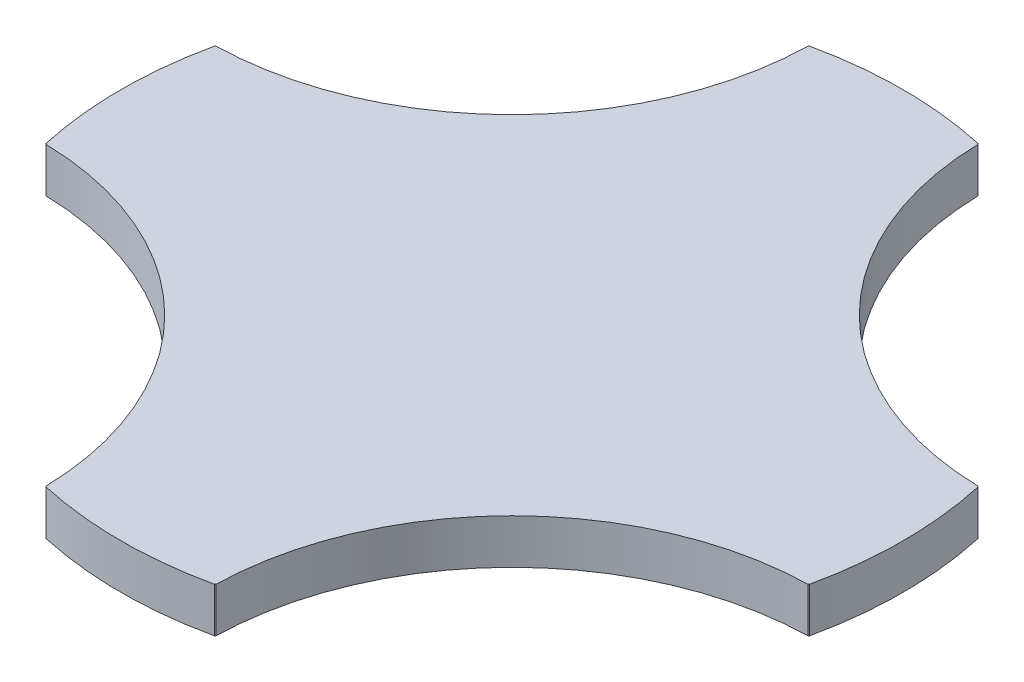
ISO-10303-21;
HEADER;
FILE_DESCRIPTION(('STEP AP214'),'2;1');
FILE_NAME('part.step','',(''),(''),'','','');
FILE_SCHEMA(('AUTOMOTIVE_DESIGN { 1 0 10303 214 1 1 1 1 }'));
ENDSEC;
DATA;
#1=APPLICATION_CONTEXT('core data for automotive mechanical design processes');
#2=APPLICATION_PROTOCOL_DEFINITION('international standard','automotive_design',2000,#1);
#3=PRODUCT_CONTEXT('',#1,'mechanical');
#4=PRODUCT('Part','Part','',(#3));
#5=PRODUCT_RELATED_PRODUCT_CATEGORY('part','',(#4));
#6=PRODUCT_DEFINITION_FORMATION('','',#4);
#7=PRODUCT_DEFINITION_CONTEXT('part definition',#1,'design');
#8=PRODUCT_DEFINITION('design','',#6,#7);
#9=PRODUCT_DEFINITION_SHAPE('','',#8);
#10=(LENGTH_UNIT() NAMED_UNIT(*) SI_UNIT(.MILLI.,.METRE.));
#11=(NAMED_UNIT(*) PLANE_ANGLE_UNIT() SI_UNIT($,.RADIAN.));
#12=(NAMED_UNIT(*) SI_UNIT($,.STERADIAN.) SOLID_ANGLE_UNIT());
#13=UNCERTAINTY_MEASURE_WITH_UNIT(LENGTH_MEASURE(1.E-05),#10,'distance_accuracy_value','');
#14=(GEOMETRIC_REPRESENTATION_CONTEXT(3) GLOBAL_UNCERTAINTY_ASSIGNED_CONTEXT((#13)) GLOBAL_UNIT_ASSIGNED_CONTEXT((#10,
#11,#12)) REPRESENTATION_CONTEXT('',''));
#15=CARTESIAN_POINT('',(0.,0.,0.));
#16=DIRECTION('',(0.,0.,1.));
#17=DIRECTION('',(1.,0.,0.));
#18=AXIS2_PLACEMENT_3D('',#15,#16,#17);
#19=CARTESIAN_POINT('',(3.12438789065523,0.359999999988175,-3.12438789064291));
#20=DIRECTION('',(0.,-1.00000000000002,0.));
#21=DIRECTION('',(0.,0.,-1.00000000000002));
#22=AXIS2_PLACEMENT_3D('',#19,#20,#21);
#23=CYLINDRICAL_SURFACE('',#22,2.44);
#24=CARTESIAN_POINT('',(3.12438789065044,-1.74860126378462E-12,-3.12438789064499));
#25=DIRECTION('',(0.,1.00000000000002,0.));
#26=DIRECTION('',(0.,0.,1.00000000000002));
#27=AXIS2_PLACEMENT_3D('',#24,#25,#26);
#28=CIRCLE('',#27,2.44);
#29=CARTESIAN_POINT('',(0.685000000012145,-2.75890421619351E-11,-3.06973700808647));
#30=VERTEX_POINT('',#29);
#31=CARTESIAN_POINT('',(3.06973700810711,-1.9595436384634E-11,-0.684999999991727));
#32=VERTEX_POINT('',#31);
#33=EDGE_CURVE('E176',#30,#32,#28,.T.);
#34=ORIENTED_EDGE('',*,*,#33,.F.);
#35=DIRECTION('',(0.,-1.00000000000002,0.));
#36=VECTOR('',#35,1.);
#37=CARTESIAN_POINT('',(0.685000000013772,0.359999999991645,-3.06973700808749));
#38=LINE('',#37,#36);
#39=CARTESIAN_POINT('',(0.685000000013772,0.359999999991645,-3.06973700808749));
#40=VERTEX_POINT('',#39);
#41=EDGE_CURVE('E11',#40,#30,#38,.T.);
#42=ORIENTED_EDGE('',*,*,#41,.F.);
#43=CARTESIAN_POINT('',(3.12438789065523,0.359999999988175,-3.12438789064291));
#44=DIRECTION('',(0.,1.00000000000002,0.));
#45=DIRECTION('',(0.,0.,1.00000000000002));
#46=AXIS2_PLACEMENT_3D('',#43,#44,#45);
#47=CIRCLE('',#46,2.44);
#48=CARTESIAN_POINT('',(3.06973700810863,0.359999999981861,-0.684999999990422));
#49=VERTEX_POINT('',#48);
#50=EDGE_CURVE('E217',#40,#49,#47,.T.);
#51=ORIENTED_EDGE('',*,*,#50,.T.);
#52=DIRECTION('',(0.,-1.00000000000002,0.));
#53=VECTOR('',#52,1.);
#54=CARTESIAN_POINT('',(3.06973700810863,0.359999999981861,-0.684999999990422));
#55=LINE('',#54,#53);
#56=EDGE_CURVE('E52',#49,#32,#55,.T.);
#57=ORIENTED_EDGE('',*,*,#56,.T.);
#58=EDGE_LOOP('',(#34,#42,#51,#57));
#59=FACE_BOUND('',#58,.T.);
#60=ADVANCED_FACE('F36',(#59),#23,.F.);
#61=CARTESIAN_POINT('',(1.87736850405985,0.359999999986343,-1.87736850403478));
#62=DIRECTION('',(0.7071067811868,0.,-0.707106781186299));
#63=DIRECTION('',(-0.707106781186278,0.,-0.707106781186803));
#64=AXIS2_PLACEMENT_3D('',#61,#62,#63);
#65=PLANE('',#64);
#66=DIRECTION('',(0.707106781186278,0.,0.707106781186803));
#67=VECTOR('',#66,1.);
#68=CARTESIAN_POINT('',(1.87736850405876,-1.41969769273942E-11,-1.87736850404097));
#69=LINE('',#68,#67);
#70=CARTESIAN_POINT('',(0.678728649891262,-2.13440376484186E-11,-3.07600835820996));
#71=VERTEX_POINT('',#70);
#72=EDGE_CURVE('E178',#71,#30,#69,.T.);
#73=ORIENTED_EDGE('',*,*,#72,.F.);
#74=DIRECTION('',(0.,-1.00000000000002,0.));
#75=VECTOR('',#74,1.);
#76=CARTESIAN_POINT('',(0.678728649882717,0.359999999985441,-3.07600835821438));
#77=LINE('',#76,#75);
#78=CARTESIAN_POINT('',(0.678728649882717,0.359999999985441,-3.07600835821438));
#79=VERTEX_POINT('',#78);
#80=EDGE_CURVE('E44',#79,#71,#77,.T.);
#81=ORIENTED_EDGE('',*,*,#80,.F.);
#82=DIRECTION('',(0.707106781186278,0.,0.707106781186803));
#83=VECTOR('',#82,1.);
#84=CARTESIAN_POINT('',(1.87736850405985,0.359999999986343,-1.87736850403478));
#85=LINE('',#84,#83);
#86=EDGE_CURVE('E257',#79,#40,#85,.T.);
#87=ORIENTED_EDGE('',*,*,#86,.T.);
#88=ORIENTED_EDGE('',*,*,#41,.T.);
#89=EDGE_LOOP('',(#73,#81,#87,#88));
#90=FACE_BOUND('',#89,.T.);
#91=ADVANCED_FACE('F256',(#90),#65,.T.);
#92=CARTESIAN_POINT('',(6.89379109353183E-12,0.35999999998812,4.48252546192407E-12));
#93=DIRECTION('',(0.,-1.00000000000002,0.));
#94=DIRECTION('',(0.,0.,-1.00000000000002));
#95=AXIS2_PLACEMENT_3D('',#92,#93,#94);
#96=CYLINDRICAL_SURFACE('',#95,3.15);
#97=CARTESIAN_POINT('',(0.,0.,0.));
#98=DIRECTION('',(0.,1.00000000000002,0.));
#99=DIRECTION('',(0.,0.,1.00000000000002));
#100=AXIS2_PLACEMENT_3D('',#97,#98,#99);
#101=CIRCLE('',#100,3.15);
#102=CARTESIAN_POINT('',(-0.678728649876436,-1.24622534514174E-11,-3.07600835820553));
#103=VERTEX_POINT('',#102);
#104=EDGE_CURVE('E181',#71,#103,#101,.T.);
#105=ORIENTED_EDGE('',*,*,#104,.T.);
#106=DIRECTION('',(0.,-1.00000000000002,0.));
#107=VECTOR('',#106,1.);
#108=CARTESIAN_POINT('',(-0.678728649874989,0.359999999979252,-3.07600835820862));
#109=LINE('',#108,#107);
#110=CARTESIAN_POINT('',(-0.678728649874989,0.359999999979252,-3.07600835820862));
#111=VERTEX_POINT('',#110);
#112=EDGE_CURVE('E242',#111,#103,#109,.T.);
#113=ORIENTED_EDGE('',*,*,#112,.F.);
#114=CARTESIAN_POINT('',(6.89379109353183E-12,0.35999999998812,4.48252546192407E-12));
#115=DIRECTION('',(0.,1.00000000000002,0.));
#116=DIRECTION('',(0.,0.,1.00000000000002));
#117=AXIS2_PLACEMENT_3D('',#114,#115,#116);
#118=CIRCLE('',#117,3.15);
#119=EDGE_CURVE('E248',#79,#111,#118,.T.);
#120=ORIENTED_EDGE('',*,*,#119,.F.);
#121=ORIENTED_EDGE('',*,*,#80,.T.);
#122=EDGE_LOOP('',(#105,#113,#120,#121));
#123=FACE_BOUND('',#122,.T.);
#124=ADVANCED_FACE('F246',(#123),#96,.T.);
#125=CARTESIAN_POINT('',(-1.8773685040446,0.359999999989952,-1.87736850404993));
#126=DIRECTION('',(-0.707106781186413,0.,-0.707106781186668));
#127=DIRECTION('',(-0.707106781186666,0.,0.707106781186433));
#128=AXIS2_PLACEMENT_3D('',#125,#126,#127);
#129=PLANE('',#128);
#130=DIRECTION('',(0.707106781186666,0.,-0.707106781186433));
#131=VECTOR('',#130,1.);
#132=CARTESIAN_POINT('',(-1.87736850404043,-2.04003480774873E-11,-1.87736850404054));
#133=LINE('',#132,#131);
#134=CARTESIAN_POINT('',(-0.684999999988349,-1.95260474455949E-11,-3.06973700809876));
#135=VERTEX_POINT('',#134);
#136=EDGE_CURVE('E184',#135,#103,#133,.T.);
#137=ORIENTED_EDGE('',*,*,#136,.F.);
#138=DIRECTION('',(0.,-1.00000000000002,0.));
#139=VECTOR('',#138,1.);
#140=CARTESIAN_POINT('',(-0.68499999998589,0.359999999980154,-3.06973700809741));
#141=LINE('',#140,#139);
#142=CARTESIAN_POINT('',(-0.68499999998589,0.359999999980154,-3.06973700809741));
#143=VERTEX_POINT('',#142);
#144=EDGE_CURVE('E240',#143,#135,#141,.T.);
#145=ORIENTED_EDGE('',*,*,#144,.F.);
#146=DIRECTION('',(0.707106781186666,0.,-0.707106781186433));
#147=VECTOR('',#146,1.);
#148=CARTESIAN_POINT('',(-1.8773685040446,0.359999999989952,-1.87736850404993));
#149=LINE('',#148,#147);
#150=EDGE_CURVE('E454',#143,#111,#149,.T.);
#151=ORIENTED_EDGE('',*,*,#150,.T.);
#152=ORIENTED_EDGE('',*,*,#112,.T.);
#153=EDGE_LOOP('',(#137,#145,#151,#152));
#154=FACE_BOUND('',#153,.T.);
#155=ADVANCED_FACE('F275',(#154),#129,.T.);
#156=CARTESIAN_POINT('',(-3.12438789063748,0.359999999989924,-3.12438789063895));
#157=DIRECTION('',(0.,-1.00000000000002,0.));
#158=DIRECTION('',(0.,0.,-1.00000000000002));
#159=AXIS2_PLACEMENT_3D('',#156,#157,#158);
#160=CYLINDRICAL_SURFACE('',#159,2.44);
#161=CARTESIAN_POINT('',(-3.1243878906377,-2.12885264971874E-11,-3.12438789063994));
#162=DIRECTION('',(0.,1.00000000000002,0.));
#163=DIRECTION('',(0.,0.,1.00000000000002));
#164=AXIS2_PLACEMENT_3D('',#161,#162,#163);
#165=CIRCLE('',#164,2.44);
#166=CARTESIAN_POINT('',(-3.06973700810717,-8.88178419700125E-13,-0.684999999998638));
#167=VERTEX_POINT('',#166);
#168=EDGE_CURVE('E187',#167,#135,#165,.T.);
#169=ORIENTED_EDGE('',*,*,#168,.F.);
#170=DIRECTION('',(0.,-1.00000000000002,0.));
#171=VECTOR('',#170,1.);
#172=CARTESIAN_POINT('',(-3.06973700809725,0.359999999981916,-0.684999999991491));
#173=LINE('',#172,#171);
#174=CARTESIAN_POINT('',(-3.06973700809725,0.359999999981916,-0.684999999991491));
#175=VERTEX_POINT('',#174);
#176=EDGE_CURVE('E238',#175,#167,#173,.T.);
#177=ORIENTED_EDGE('',*,*,#176,.F.);
#178=CARTESIAN_POINT('',(-3.12438789063748,0.359999999989924,-3.12438789063895));
#179=DIRECTION('',(0.,1.00000000000002,0.));
#180=DIRECTION('',(0.,0.,1.00000000000002));
#181=AXIS2_PLACEMENT_3D('',#178,#179,#180);
#182=CIRCLE('',#181,2.44);
#183=EDGE_CURVE('E451',#175,#143,#182,.T.);
#184=ORIENTED_EDGE('',*,*,#183,.T.);
#185=ORIENTED_EDGE('',*,*,#144,.T.);
#186=EDGE_LOOP('',(#169,#177,#184,#185));
#187=FACE_BOUND('',#186,.T.);
#188=ADVANCED_FACE('F280',(#187),#160,.F.);
#189=CARTESIAN_POINT('',(-1.87736850404081,0.35999999998286,-1.87736850404322));
#190=DIRECTION('',(-0.707106781186351,0.,-0.707106781186731));
#191=DIRECTION('',(-0.707106781186727,0.,0.707106781186373));
#192=AXIS2_PLACEMENT_3D('',#189,#190,#191);
#193=PLANE('',#192);
#194=DIRECTION('',(0.707106781186727,0.,-0.707106781186373));
#195=VECTOR('',#194,1.);
#196=CARTESIAN_POINT('',(-1.87736850403938,-2.12885264971874E-11,-1.87736850404589));
#197=LINE('',#196,#195);
#198=CARTESIAN_POINT('',(-3.07600835821023,-5.34294830600857E-12,-0.678728649888667));
#199=VERTEX_POINT('',#198);
#200=EDGE_CURVE('E190',#199,#167,#197,.T.);
#201=ORIENTED_EDGE('',*,*,#200,.F.);
#202=DIRECTION('',(0.,-1.00000000000002,0.));
#203=VECTOR('',#202,1.);
#204=CARTESIAN_POINT('',(-3.07600835821501,0.359999999998806,-0.678728649892109));
#205=LINE('',#204,#203);
#206=CARTESIAN_POINT('',(-3.07600835821501,0.359999999998806,-0.678728649892109));
#207=VERTEX_POINT('',#206);
#208=EDGE_CURVE('E236',#207,#199,#205,.T.);
#209=ORIENTED_EDGE('',*,*,#208,.F.);
#210=DIRECTION('',(0.707106781186727,0.,-0.707106781186373));
#211=VECTOR('',#210,1.);
#212=CARTESIAN_POINT('',(-1.87736850404081,0.35999999998286,-1.87736850404322));
#213=LINE('',#212,#211);
#214=EDGE_CURVE('E448',#207,#175,#213,.T.);
#215=ORIENTED_EDGE('',*,*,#214,.T.);
#216=ORIENTED_EDGE('',*,*,#176,.T.);
#217=EDGE_LOOP('',(#201,#209,#215,#216));
#218=FACE_BOUND('',#217,.T.);
#219=ADVANCED_FACE('F284',(#218),#193,.T.);
#220=CARTESIAN_POINT('',(6.89379109353183E-12,0.35999999998812,4.48252546192407E-12));
#221=DIRECTION('',(0.,-1.00000000000002,0.));
#222=DIRECTION('',(0.,0.,-1.00000000000002));
#223=AXIS2_PLACEMENT_3D('',#220,#221,#222);
#224=CYLINDRICAL_SURFACE('',#223,3.15);
#225=CARTESIAN_POINT('',(0.,0.,0.));
#226=DIRECTION('',(0.,1.00000000000002,0.));
#227=DIRECTION('',(0.,0.,1.00000000000002));
#228=AXIS2_PLACEMENT_3D('',#225,#226,#227);
#229=CIRCLE('',#228,3.15);
#230=CARTESIAN_POINT('',(-3.07600835820536,-1.78052017574259E-11,0.678728649894843));
#231=VERTEX_POINT('',#230);
#232=EDGE_CURVE('E193',#199,#231,#229,.T.);
#233=ORIENTED_EDGE('',*,*,#232,.T.);
#234=DIRECTION('',(0.,-1.00000000000002,0.));
#235=VECTOR('',#234,1.);
#236=CARTESIAN_POINT('',(-3.0760083582087,0.359999999983679,0.678728649894968));
#237=LINE('',#236,#235);
#238=CARTESIAN_POINT('',(-3.0760083582087,0.359999999983679,0.678728649894968));
#239=VERTEX_POINT('',#238);
#240=EDGE_CURVE('E233',#239,#231,#237,.T.);
#241=ORIENTED_EDGE('',*,*,#240,.F.);
#242=CARTESIAN_POINT('',(6.89379109353183E-12,0.35999999998812,4.48252546192407E-12));
#243=DIRECTION('',(0.,1.00000000000002,0.));
#244=DIRECTION('',(0.,0.,1.00000000000002));
#245=AXIS2_PLACEMENT_3D('',#242,#243,#244);
#246=CIRCLE('',#245,3.15);
#247=EDGE_CURVE('E461',#207,#239,#246,.T.);
#248=ORIENTED_EDGE('',*,*,#247,.F.);
#249=ORIENTED_EDGE('',*,*,#208,.T.);
#250=EDGE_LOOP('',(#233,#241,#248,#249));
#251=FACE_BOUND('',#250,.T.);
#252=ADVANCED_FACE('F288',(#251),#224,.T.);
#253=CARTESIAN_POINT('',(-1.87736850404237,0.359999999980154,1.87736850406204));
#254=DIRECTION('',(0.707106781186653,0.,-0.707106781186446));
#255=DIRECTION('',(-0.707106781186426,0.,-0.707106781186656));
#256=AXIS2_PLACEMENT_3D('',#253,#254,#255);
#257=PLANE('',#256);
#258=DIRECTION('',(0.707106781186424,0.,0.707106781186657));
#259=VECTOR('',#258,1.);
#260=CARTESIAN_POINT('',(-1.87736850404156,-1.77635683940025E-11,1.87736850406407));
#261=LINE('',#260,#259);
#262=CARTESIAN_POINT('',(-3.06973700809568,-1.95538030212106E-11,0.685000000015271));
#263=VERTEX_POINT('',#262);
#264=EDGE_CURVE('E195',#231,#263,#261,.T.);
#265=ORIENTED_EDGE('',*,*,#264,.T.);
#266=DIRECTION('',(0.,-1.00000000000002,0.));
#267=VECTOR('',#266,1.);
#268=CARTESIAN_POINT('',(-3.06973700809523,0.359999999975671,0.685000000010615));
#269=LINE('',#268,#267);
#270=CARTESIAN_POINT('',(-3.06973700809523,0.359999999975671,0.685000000010615));
#271=VERTEX_POINT('',#270);
#272=EDGE_CURVE('E231',#271,#263,#269,.T.);
#273=ORIENTED_EDGE('',*,*,#272,.F.);
#274=DIRECTION('',(0.707106781186424,0.,0.707106781186657));
#275=VECTOR('',#274,1.);
#276=CARTESIAN_POINT('',(-1.87736850404237,0.359999999980154,1.87736850406204));
#277=LINE('',#276,#275);
#278=EDGE_CURVE('E463',#239,#271,#277,.T.);
#279=ORIENTED_EDGE('',*,*,#278,.F.);
#280=ORIENTED_EDGE('',*,*,#240,.T.);
#281=EDGE_LOOP('',(#265,#273,#279,#280));
#282=FACE_BOUND('',#281,.T.);
#283=ADVANCED_FACE('F292',(#282),#257,.F.);
#284=CARTESIAN_POINT('',(-3.12438789063205,0.359999999991673,3.12438789065803));
#285=DIRECTION('',(0.,-1.00000000000002,0.));
#286=DIRECTION('',(0.,0.,-1.00000000000002));
#287=AXIS2_PLACEMENT_3D('',#284,#285,#286);
#288=CYLINDRICAL_SURFACE('',#287,2.44);
#289=CARTESIAN_POINT('',(-3.12438789063696,-1.59733337667944E-11,3.12438789065529));
#290=DIRECTION('',(0.,1.00000000000002,0.));
#291=DIRECTION('',(0.,0.,1.00000000000002));
#292=AXIS2_PLACEMENT_3D('',#289,#290,#291);
#293=CIRCLE('',#292,2.44);
#294=CARTESIAN_POINT('',(-0.684999999987054,-1.77635683940025E-11,3.06973700811924));
#295=VERTEX_POINT('',#294);
#296=EDGE_CURVE('E198',#295,#263,#293,.T.);
#297=ORIENTED_EDGE('',*,*,#296,.F.);
#298=DIRECTION('',(0.,-1.00000000000002,0.));
#299=VECTOR('',#298,1.);
#300=CARTESIAN_POINT('',(-0.684999999987571,0.359999999977489,3.06973700811554));
#301=LINE('',#300,#299);
#302=CARTESIAN_POINT('',(-0.684999999987571,0.359999999977489,3.06973700811554));
#303=VERTEX_POINT('',#302);
#304=EDGE_CURVE('E229',#303,#295,#301,.T.);
#305=ORIENTED_EDGE('',*,*,#304,.F.);
#306=CARTESIAN_POINT('',(-3.12438789063205,0.359999999991673,3.12438789065803));
#307=DIRECTION('',(0.,1.00000000000002,0.));
#308=DIRECTION('',(0.,0.,1.00000000000002));
#309=AXIS2_PLACEMENT_3D('',#306,#307,#308);
#310=CIRCLE('',#309,2.44);
#311=EDGE_CURVE('E439',#303,#271,#310,.T.);
#312=ORIENTED_EDGE('',*,*,#311,.T.);
#313=ORIENTED_EDGE('',*,*,#272,.T.);
#314=EDGE_LOOP('',(#297,#305,#312,#313));
#315=FACE_BOUND('',#314,.T.);
#316=ADVANCED_FACE('F296',(#315),#288,.F.);
#317=CARTESIAN_POINT('',(-1.87736850404237,0.359999999980154,1.87736850406204));
#318=DIRECTION('',(0.707106781186678,0.,-0.707106781186422));
#319=DIRECTION('',(-0.707106781186402,0.,-0.70710678118668));
#320=AXIS2_PLACEMENT_3D('',#317,#318,#319);
#321=PLANE('',#320);
#322=DIRECTION('',(0.707106781186402,0.,0.70710678118668));
#323=VECTOR('',#322,1.);
#324=CARTESIAN_POINT('',(-1.87736850404156,-1.77635683940025E-11,1.87736850406407));
#325=LINE('',#324,#323);
#326=CARTESIAN_POINT('',(-0.678728649873693,-1.95538030212106E-11,3.07600835822534));
#327=VERTEX_POINT('',#326);
#328=EDGE_CURVE('E201',#295,#327,#325,.T.);
#329=ORIENTED_EDGE('',*,*,#328,.T.);
#330=DIRECTION('',(0.,-1.00000000000002,0.));
#331=VECTOR('',#330,1.);
#332=CARTESIAN_POINT('',(-0.67872864987586,0.35999999998107,3.07600835822531));
#333=LINE('',#332,#331);
#334=CARTESIAN_POINT('',(-0.67872864987586,0.35999999998107,3.07600835822531));
#335=VERTEX_POINT('',#334);
#336=EDGE_CURVE('E226',#335,#327,#333,.T.);
#337=ORIENTED_EDGE('',*,*,#336,.F.);
#338=DIRECTION('',(0.707106781186402,0.,0.70710678118668));
#339=VECTOR('',#338,1.);
#340=CARTESIAN_POINT('',(-1.87736850404237,0.359999999980154,1.87736850406204));
#341=LINE('',#340,#339);
#342=EDGE_CURVE('E433',#303,#335,#341,.T.);
#343=ORIENTED_EDGE('',*,*,#342,.F.);
#344=ORIENTED_EDGE('',*,*,#304,.T.);
#345=EDGE_LOOP('',(#329,#337,#343,#344));
#346=FACE_BOUND('',#345,.T.);
#347=ADVANCED_FACE('F300',(#346),#321,.F.);
#348=CARTESIAN_POINT('',(6.89379109353183E-12,0.35999999998812,4.48252546192407E-12));
#349=DIRECTION('',(0.,-1.00000000000002,0.));
#350=DIRECTION('',(0.,0.,-1.00000000000002));
#351=AXIS2_PLACEMENT_3D('',#348,#349,#350);
#352=CYLINDRICAL_SURFACE('',#351,3.15);
#353=CARTESIAN_POINT('',(0.,0.,0.));
#354=DIRECTION('',(0.,1.00000000000002,0.));
#355=DIRECTION('',(0.,0.,1.00000000000002));
#356=AXIS2_PLACEMENT_3D('',#353,#354,#355);
#357=CIRCLE('',#356,3.15);
#358=CARTESIAN_POINT('',(0.678728649896461,-1.41692213517786E-11,3.07600835822483));
#359=VERTEX_POINT('',#358);
#360=EDGE_CURVE('E203',#327,#359,#357,.T.);
#361=ORIENTED_EDGE('',*,*,#360,.T.);
#362=DIRECTION('',(0.,-1.00000000000002,0.));
#363=VECTOR('',#362,1.);
#364=CARTESIAN_POINT('',(0.678728649898054,0.359999999981972,3.07600835822351));
#365=LINE('',#364,#363);
#366=CARTESIAN_POINT('',(0.678728649898054,0.359999999981972,3.07600835822351));
#367=VERTEX_POINT('',#366);
#368=EDGE_CURVE('E223',#367,#359,#365,.T.);
#369=ORIENTED_EDGE('',*,*,#368,.F.);
#370=CARTESIAN_POINT('',(6.89379109353183E-12,0.35999999998812,4.48252546192407E-12));
#371=DIRECTION('',(0.,1.00000000000002,0.));
#372=DIRECTION('',(0.,0.,1.00000000000002));
#373=AXIS2_PLACEMENT_3D('',#370,#371,#372);
#374=CIRCLE('',#373,3.15);
#375=EDGE_CURVE('E430',#335,#367,#374,.T.);
#376=ORIENTED_EDGE('',*,*,#375,.F.);
#377=ORIENTED_EDGE('',*,*,#336,.T.);
#378=EDGE_LOOP('',(#361,#369,#376,#377));
#379=FACE_BOUND('',#378,.T.);
#380=ADVANCED_FACE('F304',(#379),#352,.T.);
#381=CARTESIAN_POINT('',(1.87736850406118,0.359999999984581,1.87736850405877));
#382=DIRECTION('',(-0.707106781186426,0.,-0.707106781186656));
#383=DIRECTION('',(-0.707106781186653,0.,0.707106781186446));
#384=AXIS2_PLACEMENT_3D('',#381,#382,#383);
#385=PLANE('',#384);
#386=DIRECTION('',(0.707106781186652,0.,-0.707106781186447));
#387=VECTOR('',#386,1.);
#388=CARTESIAN_POINT('',(1.87736850406271,-2.6700863742235E-11,1.87736850406094));
#389=LINE('',#388,#387);
#390=CARTESIAN_POINT('',(0.685000000010915,-1.77774461818103E-11,3.06973700810987));
#391=VERTEX_POINT('',#390);
#392=EDGE_CURVE('E205',#359,#391,#389,.T.);
#393=ORIENTED_EDGE('',*,*,#392,.T.);
#394=DIRECTION('',(0.,-1.00000000000002,0.));
#395=VECTOR('',#394,1.);
#396=CARTESIAN_POINT('',(0.685000000009093,0.359999999976629,3.06973700811582));
#397=LINE('',#396,#395);
#398=CARTESIAN_POINT('',(0.685000000009093,0.359999999976629,3.06973700811582));
#399=VERTEX_POINT('',#398);
#400=EDGE_CURVE('E221',#399,#391,#397,.T.);
#401=ORIENTED_EDGE('',*,*,#400,.F.);
#402=DIRECTION('',(0.707106781186652,0.,-0.707106781186447));
#403=VECTOR('',#402,1.);
#404=CARTESIAN_POINT('',(1.87736850406118,0.359999999984581,1.87736850405877));
#405=LINE('',#404,#403);
#406=EDGE_CURVE('E428',#367,#399,#405,.T.);
#407=ORIENTED_EDGE('',*,*,#406,.F.);
#408=ORIENTED_EDGE('',*,*,#368,.T.);
#409=EDGE_LOOP('',(#393,#401,#407,#408));
#410=FACE_BOUND('',#409,.T.);
#411=ADVANCED_FACE('F308',(#410),#385,.F.);
#412=CARTESIAN_POINT('',(3.12438789065916,0.359999999989896,3.12438789065401));
#413=DIRECTION('',(0.,-1.00000000000002,0.));
#414=DIRECTION('',(0.,0.,-1.00000000000002));
#415=AXIS2_PLACEMENT_3D('',#412,#413,#414);
#416=CYLINDRICAL_SURFACE('',#415,2.44);
#417=CARTESIAN_POINT('',(3.12438789066089,-2.04281036531029E-11,3.12438789065846));
#418=DIRECTION('',(0.,1.00000000000002,0.));
#419=DIRECTION('',(0.,0.,1.00000000000002));
#420=AXIS2_PLACEMENT_3D('',#417,#418,#419);
#421=CIRCLE('',#420,2.44);
#422=CARTESIAN_POINT('',(3.06973700811444,-1.41830991395864E-11,0.685000000006861));
#423=VERTEX_POINT('',#422);
#424=EDGE_CURVE('E208',#423,#391,#421,.T.);
#425=ORIENTED_EDGE('',*,*,#424,.F.);
#426=DIRECTION('',(0.,-1.00000000000002,0.));
#427=VECTOR('',#426,1.);
#428=CARTESIAN_POINT('',(3.06973700811345,0.359999999976601,0.68500000000684));
#429=LINE('',#428,#427);
#430=CARTESIAN_POINT('',(3.06973700811345,0.359999999976601,0.68500000000684));
#431=VERTEX_POINT('',#430);
#432=EDGE_CURVE('E168',#431,#423,#429,.T.);
#433=ORIENTED_EDGE('',*,*,#432,.F.);
#434=CARTESIAN_POINT('',(3.12438789065916,0.359999999989896,3.12438789065401));
#435=DIRECTION('',(0.,1.00000000000002,0.));
#436=DIRECTION('',(0.,0.,1.00000000000002));
#437=AXIS2_PLACEMENT_3D('',#434,#435,#436);
#438=CIRCLE('',#437,2.44);
#439=EDGE_CURVE('E158',#431,#399,#438,.T.);
#440=ORIENTED_EDGE('',*,*,#439,.T.);
#441=ORIENTED_EDGE('',*,*,#400,.T.);
#442=EDGE_LOOP('',(#425,#433,#440,#441));
#443=FACE_BOUND('',#442,.T.);
#444=ADVANCED_FACE('F312',(#443),#416,.F.);
#445=CARTESIAN_POINT('',(1.87736850405817,0.359999999988134,1.87736850406251));
#446=DIRECTION('',(-0.707106781186388,0.,-0.707106781186693));
#447=DIRECTION('',(-0.70710678118669,0.,0.707106781186409));
#448=AXIS2_PLACEMENT_3D('',#445,#446,#447);
#449=PLANE('',#448);
#450=DIRECTION('',(0.70710678118669,0.,-0.707106781186409));
#451=VECTOR('',#450,1.);
#452=CARTESIAN_POINT('',(1.87736850406271,-2.6700863742235E-11,1.87736850406094));
#453=LINE('',#452,#451);
#454=CARTESIAN_POINT('',(3.07600835822969,-8.88178419700125E-12,0.67872864989791));
#455=VERTEX_POINT('',#454);
#456=EDGE_CURVE('E165',#423,#455,#453,.T.);
#457=ORIENTED_EDGE('',*,*,#456,.T.);
#458=DIRECTION('',(0.,-1.00000000000002,0.));
#459=VECTOR('',#458,1.);
#460=CARTESIAN_POINT('',(3.07600835822765,0.359999999979307,0.678728649894794));
#461=LINE('',#460,#459);
#462=CARTESIAN_POINT('',(3.07600835822765,0.359999999979307,0.678728649894794));
#463=VERTEX_POINT('',#462);
#464=EDGE_CURVE('E162',#463,#455,#461,.T.);
#465=ORIENTED_EDGE('',*,*,#464,.F.);
#466=DIRECTION('',(0.70710678118669,0.,-0.707106781186409));
#467=VECTOR('',#466,1.);
#468=CARTESIAN_POINT('',(1.87736850405817,0.359999999988134,1.87736850406251));
#469=LINE('',#468,#467);
#470=EDGE_CURVE('E151',#431,#463,#469,.T.);
#471=ORIENTED_EDGE('',*,*,#470,.F.);
#472=ORIENTED_EDGE('',*,*,#432,.T.);
#473=EDGE_LOOP('',(#457,#465,#471,#472));
#474=FACE_BOUND('',#473,.T.);
#475=ADVANCED_FACE('F163',(#474),#449,.F.);
#476=CARTESIAN_POINT('',(6.89379109353183E-12,0.35999999998812,4.48252546192407E-12));
#477=DIRECTION('',(0.,-1.00000000000002,0.));
#478=DIRECTION('',(0.,0.,-1.00000000000002));
#479=AXIS2_PLACEMENT_3D('',#476,#477,#478);
#480=CYLINDRICAL_SURFACE('',#479,3.15);
#481=CARTESIAN_POINT('',(0.,0.,0.));
#482=DIRECTION('',(0.,1.00000000000002,0.));
#483=DIRECTION('',(0.,0.,1.00000000000002));
#484=AXIS2_PLACEMENT_3D('',#481,#482,#483);
#485=CIRCLE('',#484,3.15);
#486=CARTESIAN_POINT('',(3.07600835823015,-1.95676808090184E-11,-0.67872864987234));
#487=VERTEX_POINT('',#486);
#488=EDGE_CURVE('E212',#455,#487,#485,.T.);
#489=ORIENTED_EDGE('',*,*,#488,.T.);
#490=DIRECTION('',(0.,-1.00000000000002,0.));
#491=VECTOR('',#490,1.);
#492=CARTESIAN_POINT('',(3.07600835823248,0.359999999986316,-0.678728649866088));
#493=LINE('',#492,#491);
#494=CARTESIAN_POINT('',(3.07600835823248,0.359999999986316,-0.678728649866088));
#495=VERTEX_POINT('',#494);
#496=EDGE_CURVE('E102',#495,#487,#493,.T.);
#497=ORIENTED_EDGE('',*,*,#496,.F.);
#498=CARTESIAN_POINT('',(6.89379109353183E-12,0.35999999998812,4.48252546192407E-12));
#499=DIRECTION('',(0.,1.00000000000002,0.));
#500=DIRECTION('',(0.,0.,1.00000000000002));
#501=AXIS2_PLACEMENT_3D('',#498,#499,#500);
#502=CIRCLE('',#501,3.15);
#503=EDGE_CURVE('E156',#463,#495,#502,.T.);
#504=ORIENTED_EDGE('',*,*,#503,.F.);
#505=ORIENTED_EDGE('',*,*,#464,.T.);
#506=EDGE_LOOP('',(#489,#497,#504,#505));
#507=FACE_BOUND('',#506,.T.);
#508=ADVANCED_FACE('F170',(#507),#480,.T.);
#509=CARTESIAN_POINT('',(1.87736850406266,0.359999999981903,-1.87736850403578));
#510=DIRECTION('',(0.707106781186605,0.,-0.707106781186495));
#511=DIRECTION('',(-0.707106781186473,0.,-0.707106781186609));
#512=AXIS2_PLACEMENT_3D('',#509,#510,#511);
#513=PLANE('',#512);
#514=DIRECTION('',(0.707106781186472,0.,0.707106781186609));
#515=VECTOR('',#514,1.);
#516=CARTESIAN_POINT('',(1.87736850404676,0.,-1.87736850404453));
#517=LINE('',#516,#515);
#518=EDGE_CURVE('E214',#32,#487,#517,.T.);
#519=ORIENTED_EDGE('',*,*,#518,.F.);
#520=ORIENTED_EDGE('',*,*,#56,.F.);
#521=DIRECTION('',(0.707106781186472,0.,0.707106781186609));
#522=VECTOR('',#521,1.);
#523=CARTESIAN_POINT('',(1.87736850406266,0.359999999981903,-1.87736850403578));
#524=LINE('',#523,#522);
#525=EDGE_CURVE('E171',#49,#495,#524,.T.);
#526=ORIENTED_EDGE('',*,*,#525,.T.);
#527=ORIENTED_EDGE('',*,*,#496,.T.);
#528=EDGE_LOOP('',(#519,#520,#526,#527));
#529=FACE_BOUND('',#528,.T.);
#530=ADVANCED_FACE('F258',(#529),#513,.T.);
#531=CARTESIAN_POINT('',(6.89379109353183E-12,0.35999999998812,4.48252546192407E-12));
#532=DIRECTION('',(0.,1.00000000000002,0.));
#533=DIRECTION('',(0.,0.,1.00000000000002));
#534=AXIS2_PLACEMENT_3D('',#531,#532,#533);
#535=PLANE('',#534);
#536=ORIENTED_EDGE('',*,*,#50,.F.);
#537=ORIENTED_EDGE('',*,*,#86,.F.);
#538=ORIENTED_EDGE('',*,*,#119,.T.);
#539=ORIENTED_EDGE('',*,*,#150,.F.);
#540=ORIENTED_EDGE('',*,*,#183,.F.);
#541=ORIENTED_EDGE('',*,*,#214,.F.);
#542=ORIENTED_EDGE('',*,*,#247,.T.);
#543=ORIENTED_EDGE('',*,*,#278,.T.);
#544=ORIENTED_EDGE('',*,*,#311,.F.);
#545=ORIENTED_EDGE('',*,*,#342,.T.);
#546=ORIENTED_EDGE('',*,*,#375,.T.);
#547=ORIENTED_EDGE('',*,*,#406,.T.);
#548=ORIENTED_EDGE('',*,*,#439,.F.);
#549=ORIENTED_EDGE('',*,*,#470,.T.);
#550=ORIENTED_EDGE('',*,*,#503,.T.);
#551=ORIENTED_EDGE('',*,*,#525,.F.);
#552=EDGE_LOOP('',(#536,#537,#538,#539,#540,#541,#542,#543,#544,#545,#546,#547,#548,#549,#550,#551));
#553=FACE_BOUND('',#552,.T.);
#554=ADVANCED_FACE('F153',(#553),#535,.T.);
#555=CARTESIAN_POINT('',(0.,0.,0.));
#556=DIRECTION('',(0.,1.00000000000002,0.));
#557=DIRECTION('',(0.,0.,1.00000000000002));
#558=AXIS2_PLACEMENT_3D('',#555,#556,#557);
#559=PLANE('',#558);
#560=ORIENTED_EDGE('',*,*,#33,.T.);
#561=ORIENTED_EDGE('',*,*,#518,.T.);
#562=ORIENTED_EDGE('',*,*,#488,.F.);
#563=ORIENTED_EDGE('',*,*,#456,.F.);
#564=ORIENTED_EDGE('',*,*,#424,.T.);
#565=ORIENTED_EDGE('',*,*,#392,.F.);
#566=ORIENTED_EDGE('',*,*,#360,.F.);
#567=ORIENTED_EDGE('',*,*,#328,.F.);
#568=ORIENTED_EDGE('',*,*,#296,.T.);
#569=ORIENTED_EDGE('',*,*,#264,.F.);
#570=ORIENTED_EDGE('',*,*,#232,.F.);
#571=ORIENTED_EDGE('',*,*,#200,.T.);
#572=ORIENTED_EDGE('',*,*,#168,.T.);
#573=ORIENTED_EDGE('',*,*,#136,.T.);
#574=ORIENTED_EDGE('',*,*,#104,.F.);
#575=ORIENTED_EDGE('',*,*,#72,.T.);
#576=EDGE_LOOP('',(#560,#561,#562,#563,#564,#565,#566,#567,#568,#569,#570,#571,#572,#573,#574,#575));
#577=FACE_BOUND('',#576,.T.);
#578=ADVANCED_FACE('F254',(#577),#559,.F.);
#579=CLOSED_SHELL('',(#60,#91,#124,#155,#188,#219,#252,#283,#316,#347,#380,#411,#444,#475,#508,
#530,#554,#578));
#580=MANIFOLD_SOLID_BREP('B2',#579);
#581=ADVANCED_BREP_SHAPE_REPRESENTATION('',(#18,#580),#14);
#582=SHAPE_DEFINITION_REPRESENTATION(#9,#581);
ENDSEC;
END-ISO-10303-21;
